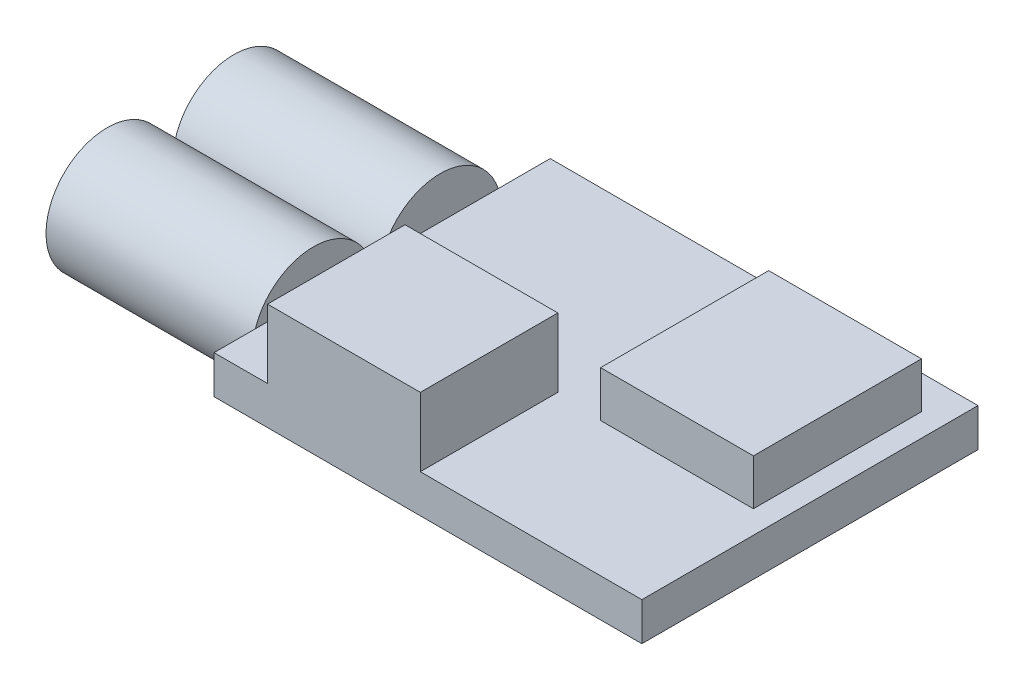
ISO-10303-21;
HEADER;
FILE_DESCRIPTION(('STEP AP214'),'2;1');
FILE_NAME('part.step','',(''),(''),'','','');
FILE_SCHEMA(('AUTOMOTIVE_DESIGN { 1 0 10303 214 1 1 1 1 }'));
ENDSEC;
DATA;
#1=APPLICATION_CONTEXT('core data for automotive mechanical design processes');
#2=APPLICATION_PROTOCOL_DEFINITION('international standard','automotive_design',2000,#1);
#3=PRODUCT_CONTEXT('',#1,'mechanical');
#4=PRODUCT('Part','Part','',(#3));
#5=PRODUCT_RELATED_PRODUCT_CATEGORY('part','',(#4));
#6=PRODUCT_DEFINITION_FORMATION('','',#4);
#7=PRODUCT_DEFINITION_CONTEXT('part definition',#1,'design');
#8=PRODUCT_DEFINITION('design','',#6,#7);
#9=PRODUCT_DEFINITION_SHAPE('','',#8);
#10=(LENGTH_UNIT() NAMED_UNIT(*) SI_UNIT(.MILLI.,.METRE.));
#11=(NAMED_UNIT(*) PLANE_ANGLE_UNIT() SI_UNIT($,.RADIAN.));
#12=(NAMED_UNIT(*) SI_UNIT($,.STERADIAN.) SOLID_ANGLE_UNIT());
#13=UNCERTAINTY_MEASURE_WITH_UNIT(LENGTH_MEASURE(1.E-05),#10,'distance_accuracy_value','');
#14=(GEOMETRIC_REPRESENTATION_CONTEXT(3) GLOBAL_UNCERTAINTY_ASSIGNED_CONTEXT((#13)) GLOBAL_UNIT_ASSIGNED_CONTEXT((#10,
#11,#12)) REPRESENTATION_CONTEXT('',''));
#15=CARTESIAN_POINT('',(0.,0.,0.));
#16=DIRECTION('',(0.,0.,1.));
#17=DIRECTION('',(1.,0.,0.));
#18=AXIS2_PLACEMENT_3D('',#15,#16,#17);
#19=CARTESIAN_POINT('',(-14.,2.5,-11.));
#20=DIRECTION('',(1.,0.,0.));
#21=DIRECTION('',(0.,0.,-1.));
#22=AXIS2_PLACEMENT_3D('',#19,#20,#21);
#23=PLANE('',#22);
#24=CARTESIAN_POINT('',(-14.,1.25,4.5));
#25=DIRECTION('',(-1.,0.,0.));
#26=DIRECTION('',(0.,0.,1.));
#27=AXIS2_PLACEMENT_3D('',#24,#25,#26);
#28=CIRCLE('',#27,4.);
#29=CARTESIAN_POINT('',(-14.,0.,8.29967103839267));
#30=VERTEX_POINT('',#29);
#31=CARTESIAN_POINT('',(-14.,2.5,8.29967103839267));
#32=VERTEX_POINT('',#31);
#33=EDGE_CURVE('E172',#30,#32,#28,.T.);
#34=ORIENTED_EDGE('',*,*,#33,.F.);
#35=DIRECTION('',(0.,0.,1.));
#36=VECTOR('',#35,1.);
#37=CARTESIAN_POINT('',(-14.,0.,-11.));
#38=LINE('',#37,#36);
#39=CARTESIAN_POINT('',(-14.,0.,11.));
#40=VERTEX_POINT('',#39);
#41=EDGE_CURVE('E159',#30,#40,#38,.T.);
#42=ORIENTED_EDGE('',*,*,#41,.T.);
#43=DIRECTION('',(0.,-1.,0.));
#44=VECTOR('',#43,1.);
#45=CARTESIAN_POINT('',(-14.,2.5,11.));
#46=LINE('',#45,#44);
#47=CARTESIAN_POINT('',(-14.,2.5,11.));
#48=VERTEX_POINT('',#47);
#49=EDGE_CURVE('E45',#48,#40,#46,.T.);
#50=ORIENTED_EDGE('',*,*,#49,.F.);
#51=DIRECTION('',(0.,0.,1.));
#52=VECTOR('',#51,1.);
#53=CARTESIAN_POINT('',(-14.,2.5,-11.));
#54=LINE('',#53,#52);
#55=EDGE_CURVE('E59',#32,#48,#54,.T.);
#56=ORIENTED_EDGE('',*,*,#55,.F.);
#57=EDGE_LOOP('',(#34,#42,#50,#56));
#58=FACE_BOUND('',#57,.T.);
#59=ADVANCED_FACE('F41',(#58),#23,.F.);
#60=CARTESIAN_POINT('',(-14.,1.25,-3.8));
#61=DIRECTION('',(-1.,0.,0.));
#62=DIRECTION('',(0.,0.,1.));
#63=AXIS2_PLACEMENT_3D('',#60,#61,#62);
#64=CIRCLE('',#63,4.);
#65=CARTESIAN_POINT('',(-14.,2.5,-7.59967103839267));
#66=VERTEX_POINT('',#65);
#67=CARTESIAN_POINT('',(-14.,0.,-7.59967103839267));
#68=VERTEX_POINT('',#67);
#69=EDGE_CURVE('E11',#66,#68,#64,.T.);
#70=ORIENTED_EDGE('',*,*,#69,.F.);
#71=CARTESIAN_POINT('',(-14.,2.5,-11.));
#72=VERTEX_POINT('',#71);
#73=EDGE_CURVE('E254',#72,#66,#54,.T.);
#74=ORIENTED_EDGE('',*,*,#73,.F.);
#75=DIRECTION('',(0.,-1.,0.));
#76=VECTOR('',#75,1.);
#77=CARTESIAN_POINT('',(-14.,2.5,-11.));
#78=LINE('',#77,#76);
#79=CARTESIAN_POINT('',(-14.,0.,-11.));
#80=VERTEX_POINT('',#79);
#81=EDGE_CURVE('E264',#72,#80,#78,.T.);
#82=ORIENTED_EDGE('',*,*,#81,.T.);
#83=EDGE_CURVE('E170',#80,#68,#38,.T.);
#84=ORIENTED_EDGE('',*,*,#83,.T.);
#85=EDGE_LOOP('',(#70,#74,#82,#84));
#86=FACE_BOUND('',#85,.T.);
#87=ADVANCED_FACE('F322',(#86),#23,.F.);
#88=CARTESIAN_POINT('',(0.,2.5,0.));
#89=DIRECTION('',(0.,1.,0.));
#90=DIRECTION('',(0.,0.,1.));
#91=AXIS2_PLACEMENT_3D('',#88,#89,#90);
#92=PLANE('',#91);
#93=DIRECTION('',(0.,0.,1.));
#94=VECTOR('',#93,1.);
#95=CARTESIAN_POINT('',(-10.5,2.5,11.));
#96=LINE('',#95,#94);
#97=CARTESIAN_POINT('',(-10.5,2.5,2.));
#98=VERTEX_POINT('',#97);
#99=CARTESIAN_POINT('',(-10.5,2.5,11.));
#100=VERTEX_POINT('',#99);
#101=EDGE_CURVE('E225',#98,#100,#96,.T.);
#102=ORIENTED_EDGE('',*,*,#101,.F.);
#103=DIRECTION('',(-1.,0.,0.));
#104=VECTOR('',#103,1.);
#105=CARTESIAN_POINT('',(-10.5,2.5,2.));
#106=LINE('',#105,#104);
#107=CARTESIAN_POINT('',(-0.5,2.5,2.));
#108=VERTEX_POINT('',#107);
#109=EDGE_CURVE('E230',#108,#98,#106,.T.);
#110=ORIENTED_EDGE('',*,*,#109,.F.);
#111=DIRECTION('',(0.,0.,-1.));
#112=VECTOR('',#111,1.);
#113=CARTESIAN_POINT('',(-0.5,2.5,11.));
#114=LINE('',#113,#112);
#115=CARTESIAN_POINT('',(-0.5,2.5,11.));
#116=VERTEX_POINT('',#115);
#117=EDGE_CURVE('E239',#116,#108,#114,.T.);
#118=ORIENTED_EDGE('',*,*,#117,.F.);
#119=DIRECTION('',(1.,0.,0.));
#120=VECTOR('',#119,1.);
#121=CARTESIAN_POINT('',(-14.,2.5,11.));
#122=LINE('',#121,#120);
#123=CARTESIAN_POINT('',(14.,2.5,11.));
#124=VERTEX_POINT('',#123);
#125=EDGE_CURVE('E257',#116,#124,#122,.T.);
#126=ORIENTED_EDGE('',*,*,#125,.T.);
#127=DIRECTION('',(0.,0.,-1.));
#128=VECTOR('',#127,1.);
#129=CARTESIAN_POINT('',(14.,2.5,-11.));
#130=LINE('',#129,#128);
#131=CARTESIAN_POINT('',(14.,2.5,-11.));
#132=VERTEX_POINT('',#131);
#133=EDGE_CURVE('E261',#124,#132,#130,.T.);
#134=ORIENTED_EDGE('',*,*,#133,.T.);
#135=DIRECTION('',(-1.,0.,0.));
#136=VECTOR('',#135,1.);
#137=CARTESIAN_POINT('',(-14.,2.5,-11.));
#138=LINE('',#137,#136);
#139=EDGE_CURVE('E263',#132,#72,#138,.T.);
#140=ORIENTED_EDGE('',*,*,#139,.T.);
#141=ORIENTED_EDGE('',*,*,#73,.T.);
#142=CARTESIAN_POINT('',(-14.,2.5,-0.000328961607334519));
#143=VERTEX_POINT('',#142);
#144=EDGE_CURVE('E258',#66,#143,#54,.T.);
#145=ORIENTED_EDGE('',*,*,#144,.T.);
#146=CARTESIAN_POINT('',(-14.,2.5,0.700328961607332));
#147=VERTEX_POINT('',#146);
#148=EDGE_CURVE('E294',#143,#147,#54,.T.);
#149=ORIENTED_EDGE('',*,*,#148,.T.);
#150=DIRECTION('',(0.,0.,1.));
#151=VECTOR('',#150,1.);
#152=CARTESIAN_POINT('',(-14.,2.5,0.));
#153=LINE('',#152,#151);
#154=EDGE_CURVE('E187',#147,#32,#153,.T.);
#155=ORIENTED_EDGE('',*,*,#154,.T.);
#156=ORIENTED_EDGE('',*,*,#55,.T.);
#157=EDGE_CURVE('E259',#48,#100,#122,.T.);
#158=ORIENTED_EDGE('',*,*,#157,.T.);
#159=EDGE_LOOP('',(#102,#110,#118,#126,#134,#140,#141,#145,#149,#155,#156,#158));
#160=FACE_BOUND('',#159,.T.);
#161=DIRECTION('',(1.,0.,0.));
#162=VECTOR('',#161,1.);
#163=CARTESIAN_POINT('',(2.5,2.5,2.2));
#164=LINE('',#163,#162);
#165=CARTESIAN_POINT('',(2.5,2.5,2.2));
#166=VERTEX_POINT('',#165);
#167=CARTESIAN_POINT('',(12.5,2.5,2.2));
#168=VERTEX_POINT('',#167);
#169=EDGE_CURVE('E210',#166,#168,#164,.T.);
#170=ORIENTED_EDGE('',*,*,#169,.F.);
#171=DIRECTION('',(0.,0.,1.));
#172=VECTOR('',#171,1.);
#173=CARTESIAN_POINT('',(2.5,2.5,-8.8));
#174=LINE('',#173,#172);
#175=CARTESIAN_POINT('',(2.5,2.5,-8.8));
#176=VERTEX_POINT('',#175);
#177=EDGE_CURVE('E193',#176,#166,#174,.T.);
#178=ORIENTED_EDGE('',*,*,#177,.F.);
#179=DIRECTION('',(-1.,0.,0.));
#180=VECTOR('',#179,1.);
#181=CARTESIAN_POINT('',(2.5,2.5,-8.8));
#182=LINE('',#181,#180);
#183=CARTESIAN_POINT('',(12.5,2.5,-8.8));
#184=VERTEX_POINT('',#183);
#185=EDGE_CURVE('E201',#184,#176,#182,.T.);
#186=ORIENTED_EDGE('',*,*,#185,.F.);
#187=DIRECTION('',(0.,0.,-1.));
#188=VECTOR('',#187,1.);
#189=CARTESIAN_POINT('',(12.5,2.5,-8.8));
#190=LINE('',#189,#188);
#191=EDGE_CURVE('E212',#168,#184,#190,.T.);
#192=ORIENTED_EDGE('',*,*,#191,.F.);
#193=EDGE_LOOP('',(#170,#178,#186,#192));
#194=FACE_BOUND('',#193,.T.);
#195=ADVANCED_FACE('F296',(#160,#194),#92,.T.);
#196=CARTESIAN_POINT('',(-14.,0.,0.700328961607332));
#197=VERTEX_POINT('',#196);
#198=EDGE_CURVE('E67',#147,#197,#28,.T.);
#199=ORIENTED_EDGE('',*,*,#198,.F.);
#200=ORIENTED_EDGE('',*,*,#148,.F.);
#201=CARTESIAN_POINT('',(-14.,0.,-0.000328961607334519));
#202=VERTEX_POINT('',#201);
#203=EDGE_CURVE('E50',#202,#143,#64,.T.);
#204=ORIENTED_EDGE('',*,*,#203,.F.);
#205=EDGE_CURVE('E184',#202,#197,#38,.T.);
#206=ORIENTED_EDGE('',*,*,#205,.T.);
#207=EDGE_LOOP('',(#199,#200,#204,#206));
#208=FACE_BOUND('',#207,.T.);
#209=ADVANCED_FACE('F43',(#208),#23,.F.);
#210=CARTESIAN_POINT('',(-14.,2.5,11.));
#211=DIRECTION('',(0.,0.,-1.));
#212=DIRECTION('',(-1.,0.,0.));
#213=AXIS2_PLACEMENT_3D('',#210,#211,#212);
#214=PLANE('',#213);
#215=DIRECTION('',(1.,0.,0.));
#216=VECTOR('',#215,1.);
#217=CARTESIAN_POINT('',(-14.,0.,11.));
#218=LINE('',#217,#216);
#219=CARTESIAN_POINT('',(14.,0.,11.));
#220=VERTEX_POINT('',#219);
#221=EDGE_CURVE('E166',#40,#220,#218,.T.);
#222=ORIENTED_EDGE('',*,*,#221,.T.);
#223=DIRECTION('',(0.,-1.,0.));
#224=VECTOR('',#223,1.);
#225=CARTESIAN_POINT('',(14.,2.5,11.));
#226=LINE('',#225,#224);
#227=EDGE_CURVE('E277',#124,#220,#226,.T.);
#228=ORIENTED_EDGE('',*,*,#227,.F.);
#229=ORIENTED_EDGE('',*,*,#125,.F.);
#230=DIRECTION('',(0.,-1.,0.));
#231=VECTOR('',#230,1.);
#232=CARTESIAN_POINT('',(-0.5,7.,11.));
#233=LINE('',#232,#231);
#234=CARTESIAN_POINT('',(-0.5,7.,11.));
#235=VERTEX_POINT('',#234);
#236=EDGE_CURVE('E249',#235,#116,#233,.T.);
#237=ORIENTED_EDGE('',*,*,#236,.F.);
#238=DIRECTION('',(1.,0.,0.));
#239=VECTOR('',#238,1.);
#240=CARTESIAN_POINT('',(-10.5,7.,11.));
#241=LINE('',#240,#239);
#242=CARTESIAN_POINT('',(-10.5,7.,11.));
#243=VERTEX_POINT('',#242);
#244=EDGE_CURVE('E229',#243,#235,#241,.T.);
#245=ORIENTED_EDGE('',*,*,#244,.F.);
#246=DIRECTION('',(0.,-1.,0.));
#247=VECTOR('',#246,1.);
#248=CARTESIAN_POINT('',(-10.5,7.,11.));
#249=LINE('',#248,#247);
#250=EDGE_CURVE('E168',#243,#100,#249,.T.);
#251=ORIENTED_EDGE('',*,*,#250,.T.);
#252=ORIENTED_EDGE('',*,*,#157,.F.);
#253=ORIENTED_EDGE('',*,*,#49,.T.);
#254=EDGE_LOOP('',(#222,#228,#229,#237,#245,#251,#252,#253));
#255=FACE_BOUND('',#254,.T.);
#256=ADVANCED_FACE('F298',(#255),#214,.F.);
#257=CARTESIAN_POINT('',(14.,2.5,-11.));
#258=DIRECTION('',(-1.,0.,0.));
#259=DIRECTION('',(0.,0.,1.));
#260=AXIS2_PLACEMENT_3D('',#257,#258,#259);
#261=PLANE('',#260);
#262=DIRECTION('',(0.,0.,-1.));
#263=VECTOR('',#262,1.);
#264=CARTESIAN_POINT('',(14.,0.,-11.));
#265=LINE('',#264,#263);
#266=CARTESIAN_POINT('',(14.,0.,-11.));
#267=VERTEX_POINT('',#266);
#268=EDGE_CURVE('E269',#220,#267,#265,.T.);
#269=ORIENTED_EDGE('',*,*,#268,.T.);
#270=DIRECTION('',(0.,-1.,0.));
#271=VECTOR('',#270,1.);
#272=CARTESIAN_POINT('',(14.,2.5,-11.));
#273=LINE('',#272,#271);
#274=EDGE_CURVE('E275',#132,#267,#273,.T.);
#275=ORIENTED_EDGE('',*,*,#274,.F.);
#276=ORIENTED_EDGE('',*,*,#133,.F.);
#277=ORIENTED_EDGE('',*,*,#227,.T.);
#278=EDGE_LOOP('',(#269,#275,#276,#277));
#279=FACE_BOUND('',#278,.T.);
#280=ADVANCED_FACE('F314',(#279),#261,.F.);
#281=CARTESIAN_POINT('',(-14.,2.5,-11.));
#282=DIRECTION('',(0.,0.,1.));
#283=DIRECTION('',(1.,0.,0.));
#284=AXIS2_PLACEMENT_3D('',#281,#282,#283);
#285=PLANE('',#284);
#286=DIRECTION('',(-1.,0.,0.));
#287=VECTOR('',#286,1.);
#288=CARTESIAN_POINT('',(-14.,0.,-11.));
#289=LINE('',#288,#287);
#290=EDGE_CURVE('E271',#267,#80,#289,.T.);
#291=ORIENTED_EDGE('',*,*,#290,.T.);
#292=ORIENTED_EDGE('',*,*,#81,.F.);
#293=ORIENTED_EDGE('',*,*,#139,.F.);
#294=ORIENTED_EDGE('',*,*,#274,.T.);
#295=EDGE_LOOP('',(#291,#292,#293,#294));
#296=FACE_BOUND('',#295,.T.);
#297=ADVANCED_FACE('F319',(#296),#285,.F.);
#298=CARTESIAN_POINT('',(0.,0.,0.));
#299=DIRECTION('',(0.,1.,0.));
#300=DIRECTION('',(0.,0.,1.));
#301=AXIS2_PLACEMENT_3D('',#298,#299,#300);
#302=PLANE('',#301);
#303=ORIENTED_EDGE('',*,*,#83,.F.);
#304=ORIENTED_EDGE('',*,*,#290,.F.);
#305=ORIENTED_EDGE('',*,*,#268,.F.);
#306=ORIENTED_EDGE('',*,*,#221,.F.);
#307=ORIENTED_EDGE('',*,*,#41,.F.);
#308=EDGE_CURVE('E164',#197,#30,#38,.T.);
#309=ORIENTED_EDGE('',*,*,#308,.F.);
#310=ORIENTED_EDGE('',*,*,#205,.F.);
#311=EDGE_CURVE('E267',#68,#202,#38,.T.);
#312=ORIENTED_EDGE('',*,*,#311,.F.);
#313=EDGE_LOOP('',(#303,#304,#305,#306,#307,#309,#310,#312));
#314=FACE_BOUND('',#313,.T.);
#315=ADVANCED_FACE('F161',(#314),#302,.F.);
#316=CARTESIAN_POINT('',(-10.5,7.,11.));
#317=DIRECTION('',(1.,0.,0.));
#318=DIRECTION('',(0.,0.,-1.));
#319=AXIS2_PLACEMENT_3D('',#316,#317,#318);
#320=PLANE('',#319);
#321=ORIENTED_EDGE('',*,*,#101,.T.);
#322=ORIENTED_EDGE('',*,*,#250,.F.);
#323=DIRECTION('',(0.,0.,1.));
#324=VECTOR('',#323,1.);
#325=CARTESIAN_POINT('',(-10.5,7.,11.));
#326=LINE('',#325,#324);
#327=CARTESIAN_POINT('',(-10.5,7.,2.));
#328=VERTEX_POINT('',#327);
#329=EDGE_CURVE('E226',#328,#243,#326,.T.);
#330=ORIENTED_EDGE('',*,*,#329,.F.);
#331=DIRECTION('',(0.,-1.,0.));
#332=VECTOR('',#331,1.);
#333=CARTESIAN_POINT('',(-10.5,7.,2.));
#334=LINE('',#333,#332);
#335=EDGE_CURVE('E236',#328,#98,#334,.T.);
#336=ORIENTED_EDGE('',*,*,#335,.T.);
#337=EDGE_LOOP('',(#321,#322,#330,#336));
#338=FACE_BOUND('',#337,.T.);
#339=ADVANCED_FACE('F303',(#338),#320,.F.);
#340=CARTESIAN_POINT('',(-0.5,7.,11.));
#341=DIRECTION('',(-1.,0.,0.));
#342=DIRECTION('',(0.,0.,1.));
#343=AXIS2_PLACEMENT_3D('',#340,#341,#342);
#344=PLANE('',#343);
#345=ORIENTED_EDGE('',*,*,#117,.T.);
#346=DIRECTION('',(0.,-1.,0.));
#347=VECTOR('',#346,1.);
#348=CARTESIAN_POINT('',(-0.5,7.,2.));
#349=LINE('',#348,#347);
#350=CARTESIAN_POINT('',(-0.5,7.,2.));
#351=VERTEX_POINT('',#350);
#352=EDGE_CURVE('E246',#351,#108,#349,.T.);
#353=ORIENTED_EDGE('',*,*,#352,.F.);
#354=DIRECTION('',(0.,0.,-1.));
#355=VECTOR('',#354,1.);
#356=CARTESIAN_POINT('',(-0.5,7.,11.));
#357=LINE('',#356,#355);
#358=EDGE_CURVE('E232',#235,#351,#357,.T.);
#359=ORIENTED_EDGE('',*,*,#358,.F.);
#360=ORIENTED_EDGE('',*,*,#236,.T.);
#361=EDGE_LOOP('',(#345,#353,#359,#360));
#362=FACE_BOUND('',#361,.T.);
#363=ADVANCED_FACE('F311',(#362),#344,.F.);
#364=CARTESIAN_POINT('',(-10.5,7.,2.));
#365=DIRECTION('',(0.,0.,1.));
#366=DIRECTION('',(1.,0.,0.));
#367=AXIS2_PLACEMENT_3D('',#364,#365,#366);
#368=PLANE('',#367);
#369=ORIENTED_EDGE('',*,*,#109,.T.);
#370=ORIENTED_EDGE('',*,*,#335,.F.);
#371=DIRECTION('',(-1.,0.,0.));
#372=VECTOR('',#371,1.);
#373=CARTESIAN_POINT('',(-10.5,7.,2.));
#374=LINE('',#373,#372);
#375=EDGE_CURVE('E234',#351,#328,#374,.T.);
#376=ORIENTED_EDGE('',*,*,#375,.F.);
#377=ORIENTED_EDGE('',*,*,#352,.T.);
#378=EDGE_LOOP('',(#369,#370,#376,#377));
#379=FACE_BOUND('',#378,.T.);
#380=ADVANCED_FACE('F306',(#379),#368,.F.);
#381=CARTESIAN_POINT('',(0.,7.,0.));
#382=DIRECTION('',(0.,-1.,0.));
#383=DIRECTION('',(0.,0.,-1.));
#384=AXIS2_PLACEMENT_3D('',#381,#382,#383);
#385=PLANE('',#384);
#386=ORIENTED_EDGE('',*,*,#329,.T.);
#387=ORIENTED_EDGE('',*,*,#244,.T.);
#388=ORIENTED_EDGE('',*,*,#358,.T.);
#389=ORIENTED_EDGE('',*,*,#375,.T.);
#390=EDGE_LOOP('',(#386,#387,#388,#389));
#391=FACE_BOUND('',#390,.T.);
#392=ADVANCED_FACE('F353',(#391),#385,.F.);
#393=CARTESIAN_POINT('',(2.5,5.5,-8.8));
#394=DIRECTION('',(1.,0.,0.));
#395=DIRECTION('',(0.,0.,-1.));
#396=AXIS2_PLACEMENT_3D('',#393,#394,#395);
#397=PLANE('',#396);
#398=ORIENTED_EDGE('',*,*,#177,.T.);
#399=DIRECTION('',(0.,-1.,0.));
#400=VECTOR('',#399,1.);
#401=CARTESIAN_POINT('',(2.5,5.5,2.2));
#402=LINE('',#401,#400);
#403=CARTESIAN_POINT('',(2.5,5.5,2.2));
#404=VERTEX_POINT('',#403);
#405=EDGE_CURVE('E223',#404,#166,#402,.T.);
#406=ORIENTED_EDGE('',*,*,#405,.F.);
#407=DIRECTION('',(0.,0.,1.));
#408=VECTOR('',#407,1.);
#409=CARTESIAN_POINT('',(2.5,5.5,-8.8));
#410=LINE('',#409,#408);
#411=CARTESIAN_POINT('',(2.5,5.5,-8.8));
#412=VERTEX_POINT('',#411);
#413=EDGE_CURVE('E197',#412,#404,#410,.T.);
#414=ORIENTED_EDGE('',*,*,#413,.F.);
#415=DIRECTION('',(0.,-1.,0.));
#416=VECTOR('',#415,1.);
#417=CARTESIAN_POINT('',(2.5,5.5,-8.8));
#418=LINE('',#417,#416);
#419=EDGE_CURVE('E207',#412,#176,#418,.T.);
#420=ORIENTED_EDGE('',*,*,#419,.T.);
#421=EDGE_LOOP('',(#398,#406,#414,#420));
#422=FACE_BOUND('',#421,.T.);
#423=ADVANCED_FACE('F356',(#422),#397,.F.);
#424=CARTESIAN_POINT('',(2.5,5.5,2.2));
#425=DIRECTION('',(0.,0.,-1.));
#426=DIRECTION('',(-1.,0.,0.));
#427=AXIS2_PLACEMENT_3D('',#424,#425,#426);
#428=PLANE('',#427);
#429=ORIENTED_EDGE('',*,*,#169,.T.);
#430=DIRECTION('',(0.,-1.,0.));
#431=VECTOR('',#430,1.);
#432=CARTESIAN_POINT('',(12.5,5.5,2.2));
#433=LINE('',#432,#431);
#434=CARTESIAN_POINT('',(12.5,5.5,2.2));
#435=VERTEX_POINT('',#434);
#436=EDGE_CURVE('E220',#435,#168,#433,.T.);
#437=ORIENTED_EDGE('',*,*,#436,.F.);
#438=DIRECTION('',(1.,0.,0.));
#439=VECTOR('',#438,1.);
#440=CARTESIAN_POINT('',(2.5,5.5,2.2));
#441=LINE('',#440,#439);
#442=EDGE_CURVE('E200',#404,#435,#441,.T.);
#443=ORIENTED_EDGE('',*,*,#442,.F.);
#444=ORIENTED_EDGE('',*,*,#405,.T.);
#445=EDGE_LOOP('',(#429,#437,#443,#444));
#446=FACE_BOUND('',#445,.T.);
#447=ADVANCED_FACE('F360',(#446),#428,.F.);
#448=CARTESIAN_POINT('',(12.5,5.5,-8.8));
#449=DIRECTION('',(-1.,0.,0.));
#450=DIRECTION('',(0.,0.,1.));
#451=AXIS2_PLACEMENT_3D('',#448,#449,#450);
#452=PLANE('',#451);
#453=ORIENTED_EDGE('',*,*,#191,.T.);
#454=DIRECTION('',(0.,-1.,0.));
#455=VECTOR('',#454,1.);
#456=CARTESIAN_POINT('',(12.5,5.5,-8.8));
#457=LINE('',#456,#455);
#458=CARTESIAN_POINT('',(12.5,5.5,-8.8));
#459=VERTEX_POINT('',#458);
#460=EDGE_CURVE('E218',#459,#184,#457,.T.);
#461=ORIENTED_EDGE('',*,*,#460,.F.);
#462=DIRECTION('',(0.,0.,-1.));
#463=VECTOR('',#462,1.);
#464=CARTESIAN_POINT('',(12.5,5.5,-8.8));
#465=LINE('',#464,#463);
#466=EDGE_CURVE('E203',#435,#459,#465,.T.);
#467=ORIENTED_EDGE('',*,*,#466,.F.);
#468=ORIENTED_EDGE('',*,*,#436,.T.);
#469=EDGE_LOOP('',(#453,#461,#467,#468));
#470=FACE_BOUND('',#469,.T.);
#471=ADVANCED_FACE('F369',(#470),#452,.F.);
#472=CARTESIAN_POINT('',(2.5,5.5,-8.8));
#473=DIRECTION('',(0.,0.,1.));
#474=DIRECTION('',(1.,0.,0.));
#475=AXIS2_PLACEMENT_3D('',#472,#473,#474);
#476=PLANE('',#475);
#477=ORIENTED_EDGE('',*,*,#185,.T.);
#478=ORIENTED_EDGE('',*,*,#419,.F.);
#479=DIRECTION('',(-1.,0.,0.));
#480=VECTOR('',#479,1.);
#481=CARTESIAN_POINT('',(2.5,5.5,-8.8));
#482=LINE('',#481,#480);
#483=EDGE_CURVE('E205',#459,#412,#482,.T.);
#484=ORIENTED_EDGE('',*,*,#483,.F.);
#485=ORIENTED_EDGE('',*,*,#460,.T.);
#486=EDGE_LOOP('',(#477,#478,#484,#485));
#487=FACE_BOUND('',#486,.T.);
#488=ADVANCED_FACE('F378',(#487),#476,.F.);
#489=CARTESIAN_POINT('',(0.,5.5,0.));
#490=DIRECTION('',(0.,1.,0.));
#491=DIRECTION('',(0.,0.,1.));
#492=AXIS2_PLACEMENT_3D('',#489,#490,#491);
#493=PLANE('',#492);
#494=ORIENTED_EDGE('',*,*,#413,.T.);
#495=ORIENTED_EDGE('',*,*,#442,.T.);
#496=ORIENTED_EDGE('',*,*,#466,.T.);
#497=ORIENTED_EDGE('',*,*,#483,.T.);
#498=EDGE_LOOP('',(#494,#495,#496,#497));
#499=FACE_BOUND('',#498,.T.);
#500=ADVANCED_FACE('F386',(#499),#493,.T.);
#501=CARTESIAN_POINT('',(-14.,1.25,-3.8));
#502=DIRECTION('',(-1.,0.,0.));
#503=DIRECTION('',(0.,0.,1.));
#504=AXIS2_PLACEMENT_3D('',#501,#502,#503);
#505=PLANE('',#504);
#506=EDGE_CURVE('E52',#68,#202,#64,.T.);
#507=ORIENTED_EDGE('',*,*,#506,.F.);
#508=ORIENTED_EDGE('',*,*,#311,.T.);
#509=EDGE_LOOP('',(#507,#508));
#510=FACE_BOUND('',#509,.T.);
#511=ADVANCED_FACE('F325',(#510),#505,.F.);
#512=CARTESIAN_POINT('',(-27.5,1.25,-3.8));
#513=DIRECTION('',(1.,0.,0.));
#514=DIRECTION('',(0.,0.,-1.));
#515=AXIS2_PLACEMENT_3D('',#512,#513,#514);
#516=CYLINDRICAL_SURFACE('',#515,4.);
#517=CARTESIAN_POINT('',(-27.5,1.25,-3.8));
#518=DIRECTION('',(-1.,0.,0.));
#519=DIRECTION('',(0.,0.,1.));
#520=AXIS2_PLACEMENT_3D('',#517,#518,#519);
#521=CIRCLE('',#520,4.);
#522=CARTESIAN_POINT('',(-27.5,1.25,0.2));
#523=VERTEX_POINT('',#522);
#524=EDGE_CURVE('E191',#523,#523,#521,.T.);
#525=ORIENTED_EDGE('',*,*,#524,.F.);
#526=EDGE_LOOP('',(#525));
#527=FACE_BOUND('',#526,.T.);
#528=EDGE_CURVE('E194',#143,#66,#64,.T.);
#529=ORIENTED_EDGE('',*,*,#528,.T.);
#530=ORIENTED_EDGE('',*,*,#69,.T.);
#531=ORIENTED_EDGE('',*,*,#506,.T.);
#532=ORIENTED_EDGE('',*,*,#203,.T.);
#533=EDGE_LOOP('',(#529,#530,#531,#532));
#534=FACE_BOUND('',#533,.T.);
#535=ADVANCED_FACE('F288',(#527,#534),#516,.T.);
#536=CARTESIAN_POINT('',(-27.5,1.25,-3.8));
#537=DIRECTION('',(-1.,0.,0.));
#538=DIRECTION('',(0.,0.,1.));
#539=AXIS2_PLACEMENT_3D('',#536,#537,#538);
#540=PLANE('',#539);
#541=ORIENTED_EDGE('',*,*,#524,.T.);
#542=EDGE_LOOP('',(#541));
#543=FACE_BOUND('',#542,.T.);
#544=ADVANCED_FACE('F418',(#543),#540,.T.);
#545=ORIENTED_EDGE('',*,*,#144,.F.);
#546=ORIENTED_EDGE('',*,*,#528,.F.);
#547=EDGE_LOOP('',(#545,#546));
#548=FACE_BOUND('',#547,.T.);
#549=ADVANCED_FACE('F292',(#548),#505,.F.);
#550=CARTESIAN_POINT('',(-14.,1.25,4.5));
#551=DIRECTION('',(-1.,0.,0.));
#552=DIRECTION('',(0.,0.,1.));
#553=AXIS2_PLACEMENT_3D('',#550,#551,#552);
#554=PLANE('',#553);
#555=EDGE_CURVE('E177',#197,#30,#28,.T.);
#556=ORIENTED_EDGE('',*,*,#555,.F.);
#557=ORIENTED_EDGE('',*,*,#308,.T.);
#558=EDGE_LOOP('',(#556,#557));
#559=FACE_BOUND('',#558,.T.);
#560=ADVANCED_FACE('F183',(#559),#554,.F.);
#561=CARTESIAN_POINT('',(-27.5,1.25,4.5));
#562=DIRECTION('',(1.,0.,0.));
#563=DIRECTION('',(0.,0.,-1.));
#564=AXIS2_PLACEMENT_3D('',#561,#562,#563);
#565=CYLINDRICAL_SURFACE('',#564,4.);
#566=CARTESIAN_POINT('',(-27.5,1.25,4.5));
#567=DIRECTION('',(-1.,0.,0.));
#568=DIRECTION('',(0.,0.,1.));
#569=AXIS2_PLACEMENT_3D('',#566,#567,#568);
#570=CIRCLE('',#569,4.);
#571=CARTESIAN_POINT('',(-27.5,1.25,8.5));
#572=VERTEX_POINT('',#571);
#573=EDGE_CURVE('E178',#572,#572,#570,.T.);
#574=ORIENTED_EDGE('',*,*,#573,.F.);
#575=EDGE_LOOP('',(#574));
#576=FACE_BOUND('',#575,.T.);
#577=EDGE_CURVE('E180',#32,#147,#28,.T.);
#578=ORIENTED_EDGE('',*,*,#577,.T.);
#579=ORIENTED_EDGE('',*,*,#198,.T.);
#580=ORIENTED_EDGE('',*,*,#555,.T.);
#581=ORIENTED_EDGE('',*,*,#33,.T.);
#582=EDGE_LOOP('',(#578,#579,#580,#581));
#583=FACE_BOUND('',#582,.T.);
#584=ADVANCED_FACE('F185',(#576,#583),#565,.T.);
#585=CARTESIAN_POINT('',(-27.5,1.25,4.5));
#586=DIRECTION('',(-1.,0.,0.));
#587=DIRECTION('',(0.,0.,1.));
#588=AXIS2_PLACEMENT_3D('',#585,#586,#587);
#589=PLANE('',#588);
#590=ORIENTED_EDGE('',*,*,#573,.T.);
#591=EDGE_LOOP('',(#590));
#592=FACE_BOUND('',#591,.T.);
#593=ADVANCED_FACE('F453',(#592),#589,.T.);
#594=ORIENTED_EDGE('',*,*,#154,.F.);
#595=ORIENTED_EDGE('',*,*,#577,.F.);
#596=EDGE_LOOP('',(#594,#595));
#597=FACE_BOUND('',#596,.T.);
#598=ADVANCED_FACE('F445',(#597),#554,.F.);
#599=CLOSED_SHELL('',(#59,#87,#195,#209,#256,#280,#297,#315,#339,#363,#380,#392,#423,#447,#471,
#488,#500,#511,#535,#544,#549,#560,#584,#593,#598));
#600=MANIFOLD_SOLID_BREP('B2',#599);
#601=ADVANCED_BREP_SHAPE_REPRESENTATION('',(#18,#600),#14);
#602=SHAPE_DEFINITION_REPRESENTATION(#9,#601);
ENDSEC;
END-ISO-10303-21;
